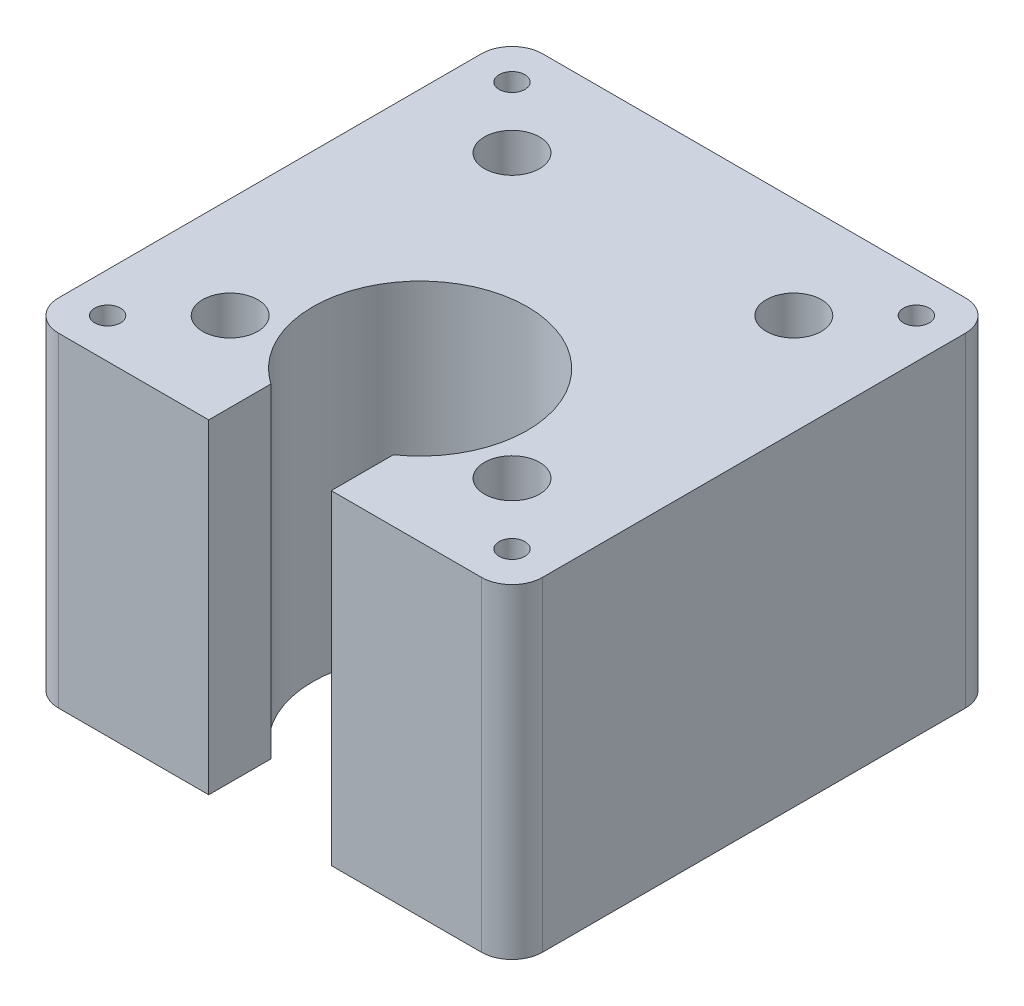
ISO-10303-21;
HEADER;
FILE_DESCRIPTION(('STEP AP214'),'2;1');
FILE_NAME('part.step','',(''),(''),'','','');
FILE_SCHEMA(('AUTOMOTIVE_DESIGN { 1 0 10303 214 1 1 1 1 }'));
ENDSEC;
DATA;
#1=APPLICATION_CONTEXT('core data for automotive mechanical design processes');
#2=APPLICATION_PROTOCOL_DEFINITION('international standard','automotive_design',2000,#1);
#3=PRODUCT_CONTEXT('',#1,'mechanical');
#4=PRODUCT('Part','Part','',(#3));
#5=PRODUCT_RELATED_PRODUCT_CATEGORY('part','',(#4));
#6=PRODUCT_DEFINITION_FORMATION('','',#4);
#7=PRODUCT_DEFINITION_CONTEXT('part definition',#1,'design');
#8=PRODUCT_DEFINITION('design','',#6,#7);
#9=PRODUCT_DEFINITION_SHAPE('','',#8);
#10=(LENGTH_UNIT() NAMED_UNIT(*) SI_UNIT(.MILLI.,.METRE.));
#11=(NAMED_UNIT(*) PLANE_ANGLE_UNIT() SI_UNIT($,.RADIAN.));
#12=(NAMED_UNIT(*) SI_UNIT($,.STERADIAN.) SOLID_ANGLE_UNIT());
#13=UNCERTAINTY_MEASURE_WITH_UNIT(LENGTH_MEASURE(1.E-05),#10,'distance_accuracy_value','');
#14=(GEOMETRIC_REPRESENTATION_CONTEXT(3) GLOBAL_UNCERTAINTY_ASSIGNED_CONTEXT((#13)) GLOBAL_UNIT_ASSIGNED_CONTEXT((#10,
#11,#12)) REPRESENTATION_CONTEXT('',''));
#15=CARTESIAN_POINT('',(0.,0.,0.));
#16=DIRECTION('',(0.,0.,1.));
#17=DIRECTION('',(1.,0.,0.));
#18=AXIS2_PLACEMENT_3D('',#15,#16,#17);
#19=CARTESIAN_POINT('',(-33.,-22.4000000001183,18.));
#20=DIRECTION('',(0.,1.,0.));
#21=DIRECTION('',(0.,0.,1.));
#22=AXIS2_PLACEMENT_3D('',#19,#20,#21);
#23=CONICAL_SURFACE('',#22,2.09999999978617,1.02974425843205);
#24=CARTESIAN_POINT('',(-33.,-23.661807300158,18.0000000003133));
#25=VERTEX_POINT('',#24);
#26=VERTEX_LOOP('',#25);
#27=FACE_BOUND('',#26,.T.);
#28=CARTESIAN_POINT('',(-33.,-22.4,18.));
#29=DIRECTION('',(0.,1.,0.));
#30=DIRECTION('',(0.,0.,1.));
#31=AXIS2_PLACEMENT_3D('',#28,#29,#30);
#32=CIRCLE('',#31,2.1);
#33=CARTESIAN_POINT('',(-33.,-22.4,20.1));
#34=VERTEX_POINT('',#33);
#35=EDGE_CURVE('E125',#34,#34,#32,.T.);
#36=ORIENTED_EDGE('',*,*,#35,.T.);
#37=EDGE_LOOP('',(#36));
#38=FACE_BOUND('',#37,.T.);
#39=ADVANCED_FACE('F17',(#27,#38),#23,.F.);
#40=CARTESIAN_POINT('',(33.,-22.4000000001183,18.));
#41=DIRECTION('',(0.,1.,0.));
#42=DIRECTION('',(0.,0.,1.));
#43=AXIS2_PLACEMENT_3D('',#40,#41,#42);
#44=CONICAL_SURFACE('',#43,2.09999999978617,1.02974425843205);
#45=CARTESIAN_POINT('',(33.,-23.661807300158,18.0000000003133));
#46=VERTEX_POINT('',#45);
#47=VERTEX_LOOP('',#46);
#48=FACE_BOUND('',#47,.T.);
#49=CARTESIAN_POINT('',(33.,-22.4,18.));
#50=DIRECTION('',(0.,1.,0.));
#51=DIRECTION('',(0.,0.,1.));
#52=AXIS2_PLACEMENT_3D('',#49,#50,#51);
#53=CIRCLE('',#52,2.1);
#54=CARTESIAN_POINT('',(33.,-22.4,20.1));
#55=VERTEX_POINT('',#54);
#56=EDGE_CURVE('E127',#55,#55,#53,.T.);
#57=ORIENTED_EDGE('',*,*,#56,.T.);
#58=EDGE_LOOP('',(#57));
#59=FACE_BOUND('',#58,.T.);
#60=ADVANCED_FACE('F122',(#48,#59),#44,.F.);
#61=CARTESIAN_POINT('',(33.,-22.4000000000046,-48.));
#62=DIRECTION('',(0.,1.,0.));
#63=DIRECTION('',(0.,0.,1.));
#64=AXIS2_PLACEMENT_3D('',#61,#62,#63);
#65=CONICAL_SURFACE('',#64,2.09999999992579,1.02974425866189);
#66=CARTESIAN_POINT('',(33.,-23.6618072999875,-47.999999999945));
#67=VERTEX_POINT('',#66);
#68=VERTEX_LOOP('',#67);
#69=FACE_BOUND('',#68,.T.);
#70=CARTESIAN_POINT('',(33.,-22.4,-48.));
#71=DIRECTION('',(0.,1.,0.));
#72=DIRECTION('',(0.,0.,1.));
#73=AXIS2_PLACEMENT_3D('',#70,#71,#72);
#74=CIRCLE('',#73,2.1);
#75=CARTESIAN_POINT('',(33.,-22.4,-45.9));
#76=VERTEX_POINT('',#75);
#77=EDGE_CURVE('E130',#76,#76,#74,.T.);
#78=ORIENTED_EDGE('',*,*,#77,.T.);
#79=EDGE_LOOP('',(#78));
#80=FACE_BOUND('',#79,.T.);
#81=ADVANCED_FACE('F450',(#69,#80),#65,.F.);
#82=CARTESIAN_POINT('',(-33.,-22.4000000000046,-48.));
#83=DIRECTION('',(0.,1.,0.));
#84=DIRECTION('',(0.,0.,1.));
#85=AXIS2_PLACEMENT_3D('',#82,#83,#84);
#86=CONICAL_SURFACE('',#85,2.09999999992579,1.02974425866189);
#87=CARTESIAN_POINT('',(-33.,-23.6618072999875,-47.999999999945));
#88=VERTEX_POINT('',#87);
#89=VERTEX_LOOP('',#88);
#90=FACE_BOUND('',#89,.T.);
#91=CARTESIAN_POINT('',(-33.,-22.4,-48.));
#92=DIRECTION('',(0.,1.,0.));
#93=DIRECTION('',(0.,0.,1.));
#94=AXIS2_PLACEMENT_3D('',#91,#92,#93);
#95=CIRCLE('',#94,2.1);
#96=CARTESIAN_POINT('',(-33.,-22.4,-45.9));
#97=VERTEX_POINT('',#96);
#98=EDGE_CURVE('E229',#97,#97,#95,.T.);
#99=ORIENTED_EDGE('',*,*,#98,.T.);
#100=EDGE_LOOP('',(#99));
#101=FACE_BOUND('',#100,.T.);
#102=ADVANCED_FACE('F447',(#90,#101),#86,.F.);
#103=CARTESIAN_POINT('',(-33.,0.,18.));
#104=DIRECTION('',(0.,1.,0.));
#105=DIRECTION('',(0.,0.,1.));
#106=AXIS2_PLACEMENT_3D('',#103,#104,#105);
#107=CYLINDRICAL_SURFACE('',#106,2.1);
#108=ORIENTED_EDGE('',*,*,#35,.F.);
#109=EDGE_LOOP('',(#108));
#110=FACE_BOUND('',#109,.T.);
#111=CARTESIAN_POINT('',(-33.,0.,18.));
#112=DIRECTION('',(0.,1.,0.));
#113=DIRECTION('',(0.,0.,1.));
#114=AXIS2_PLACEMENT_3D('',#111,#112,#113);
#115=CIRCLE('',#114,2.1);
#116=CARTESIAN_POINT('',(-33.,0.,20.1));
#117=VERTEX_POINT('',#116);
#118=EDGE_CURVE('E216',#117,#117,#115,.F.);
#119=ORIENTED_EDGE('',*,*,#118,.F.);
#120=EDGE_LOOP('',(#119));
#121=FACE_BOUND('',#120,.T.);
#122=ADVANCED_FACE('F443',(#110,#121),#107,.F.);
#123=CARTESIAN_POINT('',(33.,0.,18.));
#124=DIRECTION('',(0.,1.,0.));
#125=DIRECTION('',(0.,0.,1.));
#126=AXIS2_PLACEMENT_3D('',#123,#124,#125);
#127=CYLINDRICAL_SURFACE('',#126,2.1);
#128=ORIENTED_EDGE('',*,*,#56,.F.);
#129=EDGE_LOOP('',(#128));
#130=FACE_BOUND('',#129,.T.);
#131=CARTESIAN_POINT('',(33.,0.,18.));
#132=DIRECTION('',(0.,1.,0.));
#133=DIRECTION('',(0.,0.,1.));
#134=AXIS2_PLACEMENT_3D('',#131,#132,#133);
#135=CIRCLE('',#134,2.1);
#136=CARTESIAN_POINT('',(33.,0.,20.1));
#137=VERTEX_POINT('',#136);
#138=EDGE_CURVE('E213',#137,#137,#135,.F.);
#139=ORIENTED_EDGE('',*,*,#138,.F.);
#140=EDGE_LOOP('',(#139));
#141=FACE_BOUND('',#140,.T.);
#142=ADVANCED_FACE('F439',(#130,#141),#127,.F.);
#143=CARTESIAN_POINT('',(33.,0.,-48.));
#144=DIRECTION('',(0.,1.,0.));
#145=DIRECTION('',(0.,0.,1.));
#146=AXIS2_PLACEMENT_3D('',#143,#144,#145);
#147=CYLINDRICAL_SURFACE('',#146,2.1);
#148=ORIENTED_EDGE('',*,*,#77,.F.);
#149=EDGE_LOOP('',(#148));
#150=FACE_BOUND('',#149,.T.);
#151=CARTESIAN_POINT('',(33.,0.,-48.));
#152=DIRECTION('',(0.,1.,0.));
#153=DIRECTION('',(0.,0.,1.));
#154=AXIS2_PLACEMENT_3D('',#151,#152,#153);
#155=CIRCLE('',#154,2.1);
#156=CARTESIAN_POINT('',(33.,0.,-45.9));
#157=VERTEX_POINT('',#156);
#158=EDGE_CURVE('E210',#157,#157,#155,.F.);
#159=ORIENTED_EDGE('',*,*,#158,.F.);
#160=EDGE_LOOP('',(#159));
#161=FACE_BOUND('',#160,.T.);
#162=ADVANCED_FACE('F435',(#150,#161),#147,.F.);
#163=CARTESIAN_POINT('',(-33.,0.,-48.));
#164=DIRECTION('',(0.,1.,0.));
#165=DIRECTION('',(0.,0.,1.));
#166=AXIS2_PLACEMENT_3D('',#163,#164,#165);
#167=CYLINDRICAL_SURFACE('',#166,2.1);
#168=ORIENTED_EDGE('',*,*,#98,.F.);
#169=EDGE_LOOP('',(#168));
#170=FACE_BOUND('',#169,.T.);
#171=CARTESIAN_POINT('',(-33.,0.,-48.));
#172=DIRECTION('',(0.,1.,0.));
#173=DIRECTION('',(0.,0.,1.));
#174=AXIS2_PLACEMENT_3D('',#171,#172,#173);
#175=CIRCLE('',#174,2.1);
#176=CARTESIAN_POINT('',(-33.,0.,-45.9));
#177=VERTEX_POINT('',#176);
#178=EDGE_CURVE('E207',#177,#177,#175,.F.);
#179=ORIENTED_EDGE('',*,*,#178,.F.);
#180=EDGE_LOOP('',(#179));
#181=FACE_BOUND('',#180,.T.);
#182=ADVANCED_FACE('F431',(#170,#181),#167,.F.);
#183=CARTESIAN_POINT('',(-23.,-43.,-38.));
#184=DIRECTION('',(0.,1.,0.));
#185=DIRECTION('',(0.,0.,1.));
#186=AXIS2_PLACEMENT_3D('',#183,#184,#185);
#187=CYLINDRICAL_SURFACE('',#186,4.5);
#188=CARTESIAN_POINT('',(-23.,-43.,-38.));
#189=DIRECTION('',(0.,1.,0.));
#190=DIRECTION('',(0.,0.,1.));
#191=AXIS2_PLACEMENT_3D('',#188,#189,#190);
#192=CIRCLE('',#191,4.5);
#193=CARTESIAN_POINT('',(-23.,-43.,-33.5));
#194=VERTEX_POINT('',#193);
#195=EDGE_CURVE('E219',#194,#194,#192,.T.);
#196=ORIENTED_EDGE('',*,*,#195,.F.);
#197=EDGE_LOOP('',(#196));
#198=FACE_BOUND('',#197,.T.);
#199=CARTESIAN_POINT('',(-23.,0.,-38.));
#200=DIRECTION('',(0.,1.,0.));
#201=DIRECTION('',(0.,0.,1.));
#202=AXIS2_PLACEMENT_3D('',#199,#200,#201);
#203=CIRCLE('',#202,4.5);
#204=CARTESIAN_POINT('',(-23.,0.,-33.5));
#205=VERTEX_POINT('',#204);
#206=EDGE_CURVE('E204',#205,#205,#203,.F.);
#207=ORIENTED_EDGE('',*,*,#206,.F.);
#208=EDGE_LOOP('',(#207));
#209=FACE_BOUND('',#208,.T.);
#210=ADVANCED_FACE('F427',(#198,#209),#187,.F.);
#211=CARTESIAN_POINT('',(23.,-43.,-38.));
#212=DIRECTION('',(0.,1.,0.));
#213=DIRECTION('',(0.,0.,1.));
#214=AXIS2_PLACEMENT_3D('',#211,#212,#213);
#215=CYLINDRICAL_SURFACE('',#214,4.5);
#216=CARTESIAN_POINT('',(23.,-43.,-38.));
#217=DIRECTION('',(0.,1.,0.));
#218=DIRECTION('',(0.,0.,1.));
#219=AXIS2_PLACEMENT_3D('',#216,#217,#218);
#220=CIRCLE('',#219,4.5);
#221=CARTESIAN_POINT('',(23.,-43.,-33.5));
#222=VERTEX_POINT('',#221);
#223=EDGE_CURVE('E222',#222,#222,#220,.T.);
#224=ORIENTED_EDGE('',*,*,#223,.F.);
#225=EDGE_LOOP('',(#224));
#226=FACE_BOUND('',#225,.T.);
#227=CARTESIAN_POINT('',(23.,0.,-38.));
#228=DIRECTION('',(0.,1.,0.));
#229=DIRECTION('',(0.,0.,1.));
#230=AXIS2_PLACEMENT_3D('',#227,#228,#229);
#231=CIRCLE('',#230,4.5);
#232=CARTESIAN_POINT('',(23.,0.,-33.5));
#233=VERTEX_POINT('',#232);
#234=EDGE_CURVE('E201',#233,#233,#231,.F.);
#235=ORIENTED_EDGE('',*,*,#234,.F.);
#236=EDGE_LOOP('',(#235));
#237=FACE_BOUND('',#236,.T.);
#238=ADVANCED_FACE('F423',(#226,#237),#215,.F.);
#239=CARTESIAN_POINT('',(-23.,-43.,8.));
#240=DIRECTION('',(0.,1.,0.));
#241=DIRECTION('',(0.,0.,1.));
#242=AXIS2_PLACEMENT_3D('',#239,#240,#241);
#243=CYLINDRICAL_SURFACE('',#242,4.5);
#244=CARTESIAN_POINT('',(-23.,-43.,8.));
#245=DIRECTION('',(0.,1.,0.));
#246=DIRECTION('',(0.,0.,1.));
#247=AXIS2_PLACEMENT_3D('',#244,#245,#246);
#248=CIRCLE('',#247,4.5);
#249=CARTESIAN_POINT('',(-23.,-43.,12.5));
#250=VERTEX_POINT('',#249);
#251=EDGE_CURVE('E224',#250,#250,#248,.T.);
#252=ORIENTED_EDGE('',*,*,#251,.F.);
#253=EDGE_LOOP('',(#252));
#254=FACE_BOUND('',#253,.T.);
#255=CARTESIAN_POINT('',(-23.,0.,8.));
#256=DIRECTION('',(0.,1.,0.));
#257=DIRECTION('',(0.,0.,1.));
#258=AXIS2_PLACEMENT_3D('',#255,#256,#257);
#259=CIRCLE('',#258,4.5);
#260=CARTESIAN_POINT('',(-23.,0.,12.5));
#261=VERTEX_POINT('',#260);
#262=EDGE_CURVE('E198',#261,#261,#259,.F.);
#263=ORIENTED_EDGE('',*,*,#262,.F.);
#264=EDGE_LOOP('',(#263));
#265=FACE_BOUND('',#264,.T.);
#266=ADVANCED_FACE('F419',(#254,#265),#243,.F.);
#267=CARTESIAN_POINT('',(23.,-43.,8.));
#268=DIRECTION('',(0.,1.,0.));
#269=DIRECTION('',(0.,0.,1.));
#270=AXIS2_PLACEMENT_3D('',#267,#268,#269);
#271=CYLINDRICAL_SURFACE('',#270,4.5);
#272=CARTESIAN_POINT('',(23.,-43.,8.));
#273=DIRECTION('',(0.,1.,0.));
#274=DIRECTION('',(0.,0.,1.));
#275=AXIS2_PLACEMENT_3D('',#272,#273,#274);
#276=CIRCLE('',#275,4.5);
#277=CARTESIAN_POINT('',(23.,-43.,12.5));
#278=VERTEX_POINT('',#277);
#279=EDGE_CURVE('E20',#278,#278,#276,.T.);
#280=ORIENTED_EDGE('',*,*,#279,.F.);
#281=EDGE_LOOP('',(#280));
#282=FACE_BOUND('',#281,.T.);
#283=CARTESIAN_POINT('',(23.,0.,8.));
#284=DIRECTION('',(0.,1.,0.));
#285=DIRECTION('',(0.,0.,1.));
#286=AXIS2_PLACEMENT_3D('',#283,#284,#285);
#287=CIRCLE('',#286,4.5);
#288=CARTESIAN_POINT('',(23.,0.,12.5));
#289=VERTEX_POINT('',#288);
#290=EDGE_CURVE('E195',#289,#289,#287,.F.);
#291=ORIENTED_EDGE('',*,*,#290,.F.);
#292=EDGE_LOOP('',(#291));
#293=FACE_BOUND('',#292,.T.);
#294=ADVANCED_FACE('F416',(#282,#293),#271,.F.);
#295=CARTESIAN_POINT('',(23.,-43.,8.));
#296=DIRECTION('',(0.,1.,0.));
#297=DIRECTION('',(0.,0.,1.));
#298=AXIS2_PLACEMENT_3D('',#295,#296,#297);
#299=PLANE('',#298);
#300=ORIENTED_EDGE('',*,*,#279,.T.);
#301=EDGE_LOOP('',(#300));
#302=FACE_BOUND('',#301,.T.);
#303=CARTESIAN_POINT('',(23.,-43.,8.));
#304=DIRECTION('',(0.,1.,0.));
#305=DIRECTION('',(0.,0.,1.));
#306=AXIS2_PLACEMENT_3D('',#303,#304,#305);
#307=CIRCLE('',#306,2.75);
#308=CARTESIAN_POINT('',(23.,-43.,10.75));
#309=VERTEX_POINT('',#308);
#310=EDGE_CURVE('E192',#309,#309,#307,.F.);
#311=ORIENTED_EDGE('',*,*,#310,.T.);
#312=EDGE_LOOP('',(#311));
#313=FACE_BOUND('',#312,.T.);
#314=ADVANCED_FACE('F413',(#302,#313),#299,.T.);
#315=CARTESIAN_POINT('',(-23.,-43.,8.));
#316=DIRECTION('',(0.,1.,0.));
#317=DIRECTION('',(0.,0.,1.));
#318=AXIS2_PLACEMENT_3D('',#315,#316,#317);
#319=PLANE('',#318);
#320=ORIENTED_EDGE('',*,*,#251,.T.);
#321=EDGE_LOOP('',(#320));
#322=FACE_BOUND('',#321,.T.);
#323=CARTESIAN_POINT('',(-23.,-43.,8.));
#324=DIRECTION('',(0.,1.,0.));
#325=DIRECTION('',(0.,0.,1.));
#326=AXIS2_PLACEMENT_3D('',#323,#324,#325);
#327=CIRCLE('',#326,2.75);
#328=CARTESIAN_POINT('',(-23.,-43.,10.75));
#329=VERTEX_POINT('',#328);
#330=EDGE_CURVE('E189',#329,#329,#327,.F.);
#331=ORIENTED_EDGE('',*,*,#330,.T.);
#332=EDGE_LOOP('',(#331));
#333=FACE_BOUND('',#332,.T.);
#334=ADVANCED_FACE('F409',(#322,#333),#319,.T.);
#335=CARTESIAN_POINT('',(23.,-43.,-38.));
#336=DIRECTION('',(0.,1.,0.));
#337=DIRECTION('',(0.,0.,1.));
#338=AXIS2_PLACEMENT_3D('',#335,#336,#337);
#339=PLANE('',#338);
#340=ORIENTED_EDGE('',*,*,#223,.T.);
#341=EDGE_LOOP('',(#340));
#342=FACE_BOUND('',#341,.T.);
#343=CARTESIAN_POINT('',(23.,-43.,-38.));
#344=DIRECTION('',(0.,1.,0.));
#345=DIRECTION('',(0.,0.,1.));
#346=AXIS2_PLACEMENT_3D('',#343,#344,#345);
#347=CIRCLE('',#346,2.75);
#348=CARTESIAN_POINT('',(23.,-43.,-35.25));
#349=VERTEX_POINT('',#348);
#350=EDGE_CURVE('E186',#349,#349,#347,.F.);
#351=ORIENTED_EDGE('',*,*,#350,.T.);
#352=EDGE_LOOP('',(#351));
#353=FACE_BOUND('',#352,.T.);
#354=ADVANCED_FACE('F405',(#342,#353),#339,.T.);
#355=CARTESIAN_POINT('',(-23.,-43.,-38.));
#356=DIRECTION('',(0.,1.,0.));
#357=DIRECTION('',(0.,0.,1.));
#358=AXIS2_PLACEMENT_3D('',#355,#356,#357);
#359=PLANE('',#358);
#360=ORIENTED_EDGE('',*,*,#195,.T.);
#361=EDGE_LOOP('',(#360));
#362=FACE_BOUND('',#361,.T.);
#363=CARTESIAN_POINT('',(-23.,-43.,-38.));
#364=DIRECTION('',(0.,1.,0.));
#365=DIRECTION('',(0.,0.,1.));
#366=AXIS2_PLACEMENT_3D('',#363,#364,#365);
#367=CIRCLE('',#366,2.75);
#368=CARTESIAN_POINT('',(-23.,-43.,-35.25));
#369=VERTEX_POINT('',#368);
#370=EDGE_CURVE('E183',#369,#369,#367,.F.);
#371=ORIENTED_EDGE('',*,*,#370,.T.);
#372=EDGE_LOOP('',(#371));
#373=FACE_BOUND('',#372,.T.);
#374=ADVANCED_FACE('F401',(#362,#373),#359,.T.);
#375=CARTESIAN_POINT('',(34.5,0.,-49.5));
#376=DIRECTION('',(0.,1.,0.));
#377=DIRECTION('',(0.,0.,1.));
#378=AXIS2_PLACEMENT_3D('',#375,#376,#377);
#379=PLANE('',#378);
#380=DIRECTION('',(1.,0.,0.));
#381=VECTOR('',#380,1.);
#382=CARTESIAN_POINT('',(34.5,0.,24.5));
#383=LINE('',#382,#381);
#384=CARTESIAN_POINT('',(34.5,0.,24.5));
#385=VERTEX_POINT('',#384);
#386=CARTESIAN_POINT('',(10.,0.,24.5));
#387=VERTEX_POINT('',#386);
#388=EDGE_CURVE('E259',#385,#387,#383,.F.);
#389=ORIENTED_EDGE('',*,*,#388,.F.);
#390=CARTESIAN_POINT('',(34.5,0.,19.5));
#391=DIRECTION('',(0.,1.,0.));
#392=DIRECTION('',(0.,0.,1.));
#393=AXIS2_PLACEMENT_3D('',#390,#391,#392);
#394=CIRCLE('',#393,5.);
#395=CARTESIAN_POINT('',(39.5,0.,19.5));
#396=VERTEX_POINT('',#395);
#397=EDGE_CURVE('E164',#396,#385,#394,.F.);
#398=ORIENTED_EDGE('',*,*,#397,.F.);
#399=DIRECTION('',(0.,0.,-1.));
#400=VECTOR('',#399,1.);
#401=CARTESIAN_POINT('',(39.5,0.,-49.5));
#402=LINE('',#401,#400);
#403=CARTESIAN_POINT('',(39.5,0.,-49.5));
#404=VERTEX_POINT('',#403);
#405=EDGE_CURVE('E182',#404,#396,#402,.F.);
#406=ORIENTED_EDGE('',*,*,#405,.F.);
#407=CARTESIAN_POINT('',(34.5,0.,-49.5));
#408=DIRECTION('',(0.,1.,0.));
#409=DIRECTION('',(0.,0.,1.));
#410=AXIS2_PLACEMENT_3D('',#407,#408,#409);
#411=CIRCLE('',#410,5.);
#412=CARTESIAN_POINT('',(34.5,0.,-54.5));
#413=VERTEX_POINT('',#412);
#414=EDGE_CURVE('E105',#413,#404,#411,.F.);
#415=ORIENTED_EDGE('',*,*,#414,.F.);
#416=DIRECTION('',(-1.,0.,0.));
#417=VECTOR('',#416,1.);
#418=CARTESIAN_POINT('',(34.5,0.,-54.5));
#419=LINE('',#418,#417);
#420=CARTESIAN_POINT('',(-34.5,0.,-54.5));
#421=VERTEX_POINT('',#420);
#422=EDGE_CURVE('E99',#421,#413,#419,.F.);
#423=ORIENTED_EDGE('',*,*,#422,.F.);
#424=CARTESIAN_POINT('',(-34.5,0.,-49.5));
#425=DIRECTION('',(0.,1.,0.));
#426=DIRECTION('',(0.,0.,1.));
#427=AXIS2_PLACEMENT_3D('',#424,#425,#426);
#428=CIRCLE('',#427,5.);
#429=CARTESIAN_POINT('',(-39.5,0.,-49.5));
#430=VERTEX_POINT('',#429);
#431=EDGE_CURVE('E176',#430,#421,#428,.F.);
#432=ORIENTED_EDGE('',*,*,#431,.F.);
#433=DIRECTION('',(0.,0.,1.));
#434=VECTOR('',#433,1.);
#435=CARTESIAN_POINT('',(-39.5,0.,-49.5));
#436=LINE('',#435,#434);
#437=CARTESIAN_POINT('',(-39.5,0.,19.5));
#438=VERTEX_POINT('',#437);
#439=EDGE_CURVE('E239',#438,#430,#436,.F.);
#440=ORIENTED_EDGE('',*,*,#439,.F.);
#441=CARTESIAN_POINT('',(-34.5,0.,19.5));
#442=DIRECTION('',(0.,1.,0.));
#443=DIRECTION('',(0.,0.,1.));
#444=AXIS2_PLACEMENT_3D('',#441,#442,#443);
#445=CIRCLE('',#444,5.);
#446=CARTESIAN_POINT('',(-34.5,0.,24.5));
#447=VERTEX_POINT('',#446);
#448=EDGE_CURVE('E172',#447,#438,#445,.F.);
#449=ORIENTED_EDGE('',*,*,#448,.F.);
#450=DIRECTION('',(1.,0.,0.));
#451=VECTOR('',#450,1.);
#452=CARTESIAN_POINT('',(-10.,0.,24.5));
#453=LINE('',#452,#451);
#454=CARTESIAN_POINT('',(-10.0000000000002,0.,24.5));
#455=VERTEX_POINT('',#454);
#456=EDGE_CURVE('E243',#455,#447,#453,.F.);
#457=ORIENTED_EDGE('',*,*,#456,.F.);
#458=DIRECTION('',(0.,0.,-1.));
#459=VECTOR('',#458,1.);
#460=CARTESIAN_POINT('',(-10.,0.,14.36140661635));
#461=LINE('',#460,#459);
#462=CARTESIAN_POINT('',(-9.99999999999926,0.,14.3614066163456));
#463=VERTEX_POINT('',#462);
#464=EDGE_CURVE('E248',#463,#455,#461,.F.);
#465=ORIENTED_EDGE('',*,*,#464,.F.);
#466=CARTESIAN_POINT('',(0.,0.,0.));
#467=DIRECTION('',(0.,1.,0.));
#468=DIRECTION('',(0.,0.,1.));
#469=AXIS2_PLACEMENT_3D('',#466,#467,#468);
#470=CIRCLE('',#469,17.5);
#471=CARTESIAN_POINT('',(10.,0.,14.3614066163463));
#472=VERTEX_POINT('',#471);
#473=EDGE_CURVE('E167',#463,#472,#470,.F.);
#474=ORIENTED_EDGE('',*,*,#473,.T.);
#475=DIRECTION('',(0.,0.,1.));
#476=VECTOR('',#475,1.);
#477=CARTESIAN_POINT('',(10.,0.,14.36140661634));
#478=LINE('',#477,#476);
#479=EDGE_CURVE('E253',#387,#472,#478,.F.);
#480=ORIENTED_EDGE('',*,*,#479,.F.);
#481=EDGE_LOOP('',(#389,#398,#406,#415,#423,#432,#440,#449,#457,#465,#474,#480));
#482=FACE_BOUND('',#481,.T.);
#483=ORIENTED_EDGE('',*,*,#290,.T.);
#484=EDGE_LOOP('',(#483));
#485=FACE_BOUND('',#484,.T.);
#486=ORIENTED_EDGE('',*,*,#262,.T.);
#487=EDGE_LOOP('',(#486));
#488=FACE_BOUND('',#487,.T.);
#489=ORIENTED_EDGE('',*,*,#234,.T.);
#490=EDGE_LOOP('',(#489));
#491=FACE_BOUND('',#490,.T.);
#492=ORIENTED_EDGE('',*,*,#206,.T.);
#493=EDGE_LOOP('',(#492));
#494=FACE_BOUND('',#493,.T.);
#495=ORIENTED_EDGE('',*,*,#178,.T.);
#496=EDGE_LOOP('',(#495));
#497=FACE_BOUND('',#496,.T.);
#498=ORIENTED_EDGE('',*,*,#158,.T.);
#499=EDGE_LOOP('',(#498));
#500=FACE_BOUND('',#499,.T.);
#501=ORIENTED_EDGE('',*,*,#138,.T.);
#502=EDGE_LOOP('',(#501));
#503=FACE_BOUND('',#502,.T.);
#504=ORIENTED_EDGE('',*,*,#118,.T.);
#505=EDGE_LOOP('',(#504));
#506=FACE_BOUND('',#505,.T.);
#507=ADVANCED_FACE('F397',(#482,#485,#488,#491,#494,#497,#500,#503,#506),#379,.T.);
#508=CARTESIAN_POINT('',(23.,-53.,8.));
#509=DIRECTION('',(0.,1.,0.));
#510=DIRECTION('',(0.,0.,1.));
#511=AXIS2_PLACEMENT_3D('',#508,#509,#510);
#512=CYLINDRICAL_SURFACE('',#511,2.75);
#513=ORIENTED_EDGE('',*,*,#310,.F.);
#514=EDGE_LOOP('',(#513));
#515=FACE_BOUND('',#514,.T.);
#516=CARTESIAN_POINT('',(23.,-53.,8.));
#517=DIRECTION('',(0.,1.,0.));
#518=DIRECTION('',(0.,0.,1.));
#519=AXIS2_PLACEMENT_3D('',#516,#517,#518);
#520=CIRCLE('',#519,2.75);
#521=CARTESIAN_POINT('',(23.,-53.,10.75));
#522=VERTEX_POINT('',#521);
#523=EDGE_CURVE('E161',#522,#522,#520,.F.);
#524=ORIENTED_EDGE('',*,*,#523,.T.);
#525=EDGE_LOOP('',(#524));
#526=FACE_BOUND('',#525,.T.);
#527=ADVANCED_FACE('F393',(#515,#526),#512,.F.);
#528=CARTESIAN_POINT('',(-23.,-53.,8.));
#529=DIRECTION('',(0.,1.,0.));
#530=DIRECTION('',(0.,0.,1.));
#531=AXIS2_PLACEMENT_3D('',#528,#529,#530);
#532=CYLINDRICAL_SURFACE('',#531,2.75);
#533=ORIENTED_EDGE('',*,*,#330,.F.);
#534=EDGE_LOOP('',(#533));
#535=FACE_BOUND('',#534,.T.);
#536=CARTESIAN_POINT('',(-23.,-53.,8.));
#537=DIRECTION('',(0.,1.,0.));
#538=DIRECTION('',(0.,0.,1.));
#539=AXIS2_PLACEMENT_3D('',#536,#537,#538);
#540=CIRCLE('',#539,2.75);
#541=CARTESIAN_POINT('',(-23.,-53.,10.75));
#542=VERTEX_POINT('',#541);
#543=EDGE_CURVE('E158',#542,#542,#540,.F.);
#544=ORIENTED_EDGE('',*,*,#543,.T.);
#545=EDGE_LOOP('',(#544));
#546=FACE_BOUND('',#545,.T.);
#547=ADVANCED_FACE('F389',(#535,#546),#532,.F.);
#548=CARTESIAN_POINT('',(23.,-53.,-38.));
#549=DIRECTION('',(0.,1.,0.));
#550=DIRECTION('',(0.,0.,1.));
#551=AXIS2_PLACEMENT_3D('',#548,#549,#550);
#552=CYLINDRICAL_SURFACE('',#551,2.75);
#553=ORIENTED_EDGE('',*,*,#350,.F.);
#554=EDGE_LOOP('',(#553));
#555=FACE_BOUND('',#554,.T.);
#556=CARTESIAN_POINT('',(23.,-53.,-38.));
#557=DIRECTION('',(0.,1.,0.));
#558=DIRECTION('',(0.,0.,1.));
#559=AXIS2_PLACEMENT_3D('',#556,#557,#558);
#560=CIRCLE('',#559,2.75);
#561=CARTESIAN_POINT('',(23.,-53.,-35.25));
#562=VERTEX_POINT('',#561);
#563=EDGE_CURVE('E155',#562,#562,#560,.F.);
#564=ORIENTED_EDGE('',*,*,#563,.T.);
#565=EDGE_LOOP('',(#564));
#566=FACE_BOUND('',#565,.T.);
#567=ADVANCED_FACE('F385',(#555,#566),#552,.F.);
#568=CARTESIAN_POINT('',(-23.,-53.,-38.));
#569=DIRECTION('',(0.,1.,0.));
#570=DIRECTION('',(0.,0.,1.));
#571=AXIS2_PLACEMENT_3D('',#568,#569,#570);
#572=CYLINDRICAL_SURFACE('',#571,2.75);
#573=ORIENTED_EDGE('',*,*,#370,.F.);
#574=EDGE_LOOP('',(#573));
#575=FACE_BOUND('',#574,.T.);
#576=CARTESIAN_POINT('',(-23.,-53.,-38.));
#577=DIRECTION('',(0.,1.,0.));
#578=DIRECTION('',(0.,0.,1.));
#579=AXIS2_PLACEMENT_3D('',#576,#577,#578);
#580=CIRCLE('',#579,2.75);
#581=CARTESIAN_POINT('',(-23.,-53.,-35.25));
#582=VERTEX_POINT('',#581);
#583=EDGE_CURVE('E152',#582,#582,#580,.F.);
#584=ORIENTED_EDGE('',*,*,#583,.T.);
#585=EDGE_LOOP('',(#584));
#586=FACE_BOUND('',#585,.T.);
#587=ADVANCED_FACE('F382',(#575,#586),#572,.F.);
#588=CARTESIAN_POINT('',(39.5,-53.,-49.5));
#589=DIRECTION('',(1.,0.,0.));
#590=DIRECTION('',(0.,0.,-1.));
#591=AXIS2_PLACEMENT_3D('',#588,#589,#590);
#592=PLANE('',#591);
#593=DIRECTION('',(0.,1.,0.));
#594=VECTOR('',#593,1.);
#595=CARTESIAN_POINT('',(39.5,-53.,19.5));
#596=LINE('',#595,#594);
#597=CARTESIAN_POINT('',(39.5,-53.,19.5));
#598=VERTEX_POINT('',#597);
#599=EDGE_CURVE('E166',#598,#396,#596,.T.);
#600=ORIENTED_EDGE('',*,*,#599,.F.);
#601=DIRECTION('',(0.,0.,1.));
#602=VECTOR('',#601,1.);
#603=CARTESIAN_POINT('',(39.5,-53.,-49.5));
#604=LINE('',#603,#602);
#605=CARTESIAN_POINT('',(39.5,-53.,-49.5));
#606=VERTEX_POINT('',#605);
#607=EDGE_CURVE('E151',#598,#606,#604,.F.);
#608=ORIENTED_EDGE('',*,*,#607,.T.);
#609=DIRECTION('',(0.,1.,0.));
#610=VECTOR('',#609,1.);
#611=CARTESIAN_POINT('',(39.5,-53.,-49.5));
#612=LINE('',#611,#610);
#613=EDGE_CURVE('E181',#404,#606,#612,.F.);
#614=ORIENTED_EDGE('',*,*,#613,.F.);
#615=ORIENTED_EDGE('',*,*,#405,.T.);
#616=EDGE_LOOP('',(#600,#608,#614,#615));
#617=FACE_BOUND('',#616,.T.);
#618=ADVANCED_FACE('F349',(#617),#592,.T.);
#619=CARTESIAN_POINT('',(34.5,-53.,-49.5));
#620=DIRECTION('',(0.,1.,0.));
#621=DIRECTION('',(0.,0.,1.));
#622=AXIS2_PLACEMENT_3D('',#619,#620,#621);
#623=CYLINDRICAL_SURFACE('',#622,5.);
#624=ORIENTED_EDGE('',*,*,#613,.T.);
#625=CARTESIAN_POINT('',(34.5,-53.,-49.5));
#626=DIRECTION('',(0.,1.,0.));
#627=DIRECTION('',(0.,0.,1.));
#628=AXIS2_PLACEMENT_3D('',#625,#626,#627);
#629=CIRCLE('',#628,5.);
#630=CARTESIAN_POINT('',(34.5,-53.,-54.5));
#631=VERTEX_POINT('',#630);
#632=EDGE_CURVE('E148',#606,#631,#629,.T.);
#633=ORIENTED_EDGE('',*,*,#632,.T.);
#634=DIRECTION('',(0.,1.,0.));
#635=VECTOR('',#634,1.);
#636=CARTESIAN_POINT('',(34.5,-53.,-54.5));
#637=LINE('',#636,#635);
#638=EDGE_CURVE('E179',#413,#631,#637,.F.);
#639=ORIENTED_EDGE('',*,*,#638,.F.);
#640=ORIENTED_EDGE('',*,*,#414,.T.);
#641=EDGE_LOOP('',(#624,#633,#639,#640));
#642=FACE_BOUND('',#641,.T.);
#643=ADVANCED_FACE('F345',(#642),#623,.T.);
#644=CARTESIAN_POINT('',(34.5,-53.,-54.5));
#645=DIRECTION('',(0.,0.,-1.));
#646=DIRECTION('',(-1.,0.,0.));
#647=AXIS2_PLACEMENT_3D('',#644,#645,#646);
#648=PLANE('',#647);
#649=ORIENTED_EDGE('',*,*,#638,.T.);
#650=DIRECTION('',(1.,0.,0.));
#651=VECTOR('',#650,1.);
#652=CARTESIAN_POINT('',(34.5,-53.,-54.5));
#653=LINE('',#652,#651);
#654=CARTESIAN_POINT('',(-34.5,-53.,-54.5));
#655=VERTEX_POINT('',#654);
#656=EDGE_CURVE('E147',#631,#655,#653,.F.);
#657=ORIENTED_EDGE('',*,*,#656,.T.);
#658=DIRECTION('',(0.,1.,0.));
#659=VECTOR('',#658,1.);
#660=CARTESIAN_POINT('',(-34.5,-53.,-54.5));
#661=LINE('',#660,#659);
#662=EDGE_CURVE('E178',#421,#655,#661,.F.);
#663=ORIENTED_EDGE('',*,*,#662,.F.);
#664=ORIENTED_EDGE('',*,*,#422,.T.);
#665=EDGE_LOOP('',(#649,#657,#663,#664));
#666=FACE_BOUND('',#665,.T.);
#667=ADVANCED_FACE('F343',(#666),#648,.T.);
#668=CARTESIAN_POINT('',(-34.5,-53.,-49.5));
#669=DIRECTION('',(0.,1.,0.));
#670=DIRECTION('',(0.,0.,1.));
#671=AXIS2_PLACEMENT_3D('',#668,#669,#670);
#672=CYLINDRICAL_SURFACE('',#671,5.);
#673=ORIENTED_EDGE('',*,*,#662,.T.);
#674=CARTESIAN_POINT('',(-34.5,-53.,-49.5));
#675=DIRECTION('',(0.,1.,0.));
#676=DIRECTION('',(0.,0.,1.));
#677=AXIS2_PLACEMENT_3D('',#674,#675,#676);
#678=CIRCLE('',#677,5.);
#679=CARTESIAN_POINT('',(-39.5,-53.,-49.5));
#680=VERTEX_POINT('',#679);
#681=EDGE_CURVE('E144',#655,#680,#678,.T.);
#682=ORIENTED_EDGE('',*,*,#681,.T.);
#683=DIRECTION('',(0.,1.,0.));
#684=VECTOR('',#683,1.);
#685=CARTESIAN_POINT('',(-39.5,-53.,-49.5));
#686=LINE('',#685,#684);
#687=EDGE_CURVE('E175',#430,#680,#686,.F.);
#688=ORIENTED_EDGE('',*,*,#687,.F.);
#689=ORIENTED_EDGE('',*,*,#431,.T.);
#690=EDGE_LOOP('',(#673,#682,#688,#689));
#691=FACE_BOUND('',#690,.T.);
#692=ADVANCED_FACE('F342',(#691),#672,.T.);
#693=CARTESIAN_POINT('',(-39.5,-53.,-49.5));
#694=DIRECTION('',(-1.,0.,0.));
#695=DIRECTION('',(0.,0.,1.));
#696=AXIS2_PLACEMENT_3D('',#693,#694,#695);
#697=PLANE('',#696);
#698=ORIENTED_EDGE('',*,*,#687,.T.);
#699=DIRECTION('',(0.,0.,1.));
#700=VECTOR('',#699,1.);
#701=CARTESIAN_POINT('',(-39.5,-53.,-49.5));
#702=LINE('',#701,#700);
#703=CARTESIAN_POINT('',(-39.5,-53.,19.5));
#704=VERTEX_POINT('',#703);
#705=EDGE_CURVE('E143',#680,#704,#702,.T.);
#706=ORIENTED_EDGE('',*,*,#705,.T.);
#707=DIRECTION('',(0.,1.,0.));
#708=VECTOR('',#707,1.);
#709=CARTESIAN_POINT('',(-39.5,-53.,19.5));
#710=LINE('',#709,#708);
#711=EDGE_CURVE('E174',#438,#704,#710,.F.);
#712=ORIENTED_EDGE('',*,*,#711,.F.);
#713=ORIENTED_EDGE('',*,*,#439,.T.);
#714=EDGE_LOOP('',(#698,#706,#712,#713));
#715=FACE_BOUND('',#714,.T.);
#716=ADVANCED_FACE('F336',(#715),#697,.T.);
#717=CARTESIAN_POINT('',(-34.5,-53.,19.5));
#718=DIRECTION('',(0.,1.,0.));
#719=DIRECTION('',(0.,0.,1.));
#720=AXIS2_PLACEMENT_3D('',#717,#718,#719);
#721=CYLINDRICAL_SURFACE('',#720,5.);
#722=ORIENTED_EDGE('',*,*,#711,.T.);
#723=CARTESIAN_POINT('',(-34.5,-53.,19.5));
#724=DIRECTION('',(0.,1.,0.));
#725=DIRECTION('',(0.,0.,1.));
#726=AXIS2_PLACEMENT_3D('',#723,#724,#725);
#727=CIRCLE('',#726,5.);
#728=CARTESIAN_POINT('',(-34.5,-53.,24.5));
#729=VERTEX_POINT('',#728);
#730=EDGE_CURVE('E139',#704,#729,#727,.T.);
#731=ORIENTED_EDGE('',*,*,#730,.T.);
#732=DIRECTION('',(0.,1.,0.));
#733=VECTOR('',#732,1.);
#734=CARTESIAN_POINT('',(-34.5,-53.,24.5));
#735=LINE('',#734,#733);
#736=EDGE_CURVE('E245',#447,#729,#735,.F.);
#737=ORIENTED_EDGE('',*,*,#736,.F.);
#738=ORIENTED_EDGE('',*,*,#448,.T.);
#739=EDGE_LOOP('',(#722,#731,#737,#738));
#740=FACE_BOUND('',#739,.T.);
#741=ADVANCED_FACE('F332',(#740),#721,.T.);
#742=CARTESIAN_POINT('',(-10.,-53.,24.5));
#743=DIRECTION('',(0.,0.,1.));
#744=DIRECTION('',(1.,0.,0.));
#745=AXIS2_PLACEMENT_3D('',#742,#743,#744);
#746=PLANE('',#745);
#747=ORIENTED_EDGE('',*,*,#736,.T.);
#748=DIRECTION('',(1.,0.,0.));
#749=VECTOR('',#748,1.);
#750=CARTESIAN_POINT('',(34.5,-53.,24.5));
#751=LINE('',#750,#749);
#752=CARTESIAN_POINT('',(-10.0000000000001,-53.,24.5));
#753=VERTEX_POINT('',#752);
#754=EDGE_CURVE('E142',#729,#753,#751,.T.);
#755=ORIENTED_EDGE('',*,*,#754,.T.);
#756=DIRECTION('',(0.,1.,0.));
#757=VECTOR('',#756,1.);
#758=CARTESIAN_POINT('',(-10.0000000000002,-53.,24.5));
#759=LINE('',#758,#757);
#760=EDGE_CURVE('E171',#455,#753,#759,.F.);
#761=ORIENTED_EDGE('',*,*,#760,.F.);
#762=ORIENTED_EDGE('',*,*,#456,.T.);
#763=EDGE_LOOP('',(#747,#755,#761,#762));
#764=FACE_BOUND('',#763,.T.);
#765=ADVANCED_FACE('F326',(#764),#746,.T.);
#766=CARTESIAN_POINT('',(-10.,-53.,14.36140661635));
#767=DIRECTION('',(1.,0.,0.));
#768=DIRECTION('',(0.,0.,-1.));
#769=AXIS2_PLACEMENT_3D('',#766,#767,#768);
#770=PLANE('',#769);
#771=ORIENTED_EDGE('',*,*,#760,.T.);
#772=DIRECTION('',(0.,0.,1.));
#773=VECTOR('',#772,1.);
#774=CARTESIAN_POINT('',(-10.0000000000001,-53.,-49.5));
#775=LINE('',#774,#773);
#776=CARTESIAN_POINT('',(-9.99999999999929,-53.,14.3614066163456));
#777=VERTEX_POINT('',#776);
#778=EDGE_CURVE('E138',#753,#777,#775,.F.);
#779=ORIENTED_EDGE('',*,*,#778,.T.);
#780=DIRECTION('',(0.,1.,0.));
#781=VECTOR('',#780,1.);
#782=CARTESIAN_POINT('',(-9.99999999999851,-53.,14.3614066163461));
#783=LINE('',#782,#781);
#784=EDGE_CURVE('E170',#777,#463,#783,.T.);
#785=ORIENTED_EDGE('',*,*,#784,.T.);
#786=ORIENTED_EDGE('',*,*,#464,.T.);
#787=EDGE_LOOP('',(#771,#779,#785,#786));
#788=FACE_BOUND('',#787,.T.);
#789=ADVANCED_FACE('F322',(#788),#770,.T.);
#790=CARTESIAN_POINT('',(0.,-53.,0.));
#791=DIRECTION('',(0.,1.,0.));
#792=DIRECTION('',(0.,0.,1.));
#793=AXIS2_PLACEMENT_3D('',#790,#791,#792);
#794=CYLINDRICAL_SURFACE('',#793,17.5);
#795=CARTESIAN_POINT('',(0.,-53.,0.));
#796=DIRECTION('',(0.,1.,0.));
#797=DIRECTION('',(0.,0.,1.));
#798=AXIS2_PLACEMENT_3D('',#795,#796,#797);
#799=CIRCLE('',#798,17.5);
#800=CARTESIAN_POINT('',(9.99999999999975,-53.,14.3614066163465));
#801=VERTEX_POINT('',#800);
#802=EDGE_CURVE('E134',#777,#801,#799,.F.);
#803=ORIENTED_EDGE('',*,*,#802,.T.);
#804=DIRECTION('',(0.,1.,0.));
#805=VECTOR('',#804,1.);
#806=CARTESIAN_POINT('',(10.,-53.,14.3614066163475));
#807=LINE('',#806,#805);
#808=EDGE_CURVE('E255',#472,#801,#807,.F.);
#809=ORIENTED_EDGE('',*,*,#808,.F.);
#810=ORIENTED_EDGE('',*,*,#473,.F.);
#811=ORIENTED_EDGE('',*,*,#784,.F.);
#812=EDGE_LOOP('',(#803,#809,#810,#811));
#813=FACE_BOUND('',#812,.T.);
#814=ADVANCED_FACE('F317',(#813),#794,.F.);
#815=CARTESIAN_POINT('',(10.,-53.,14.36140661634));
#816=DIRECTION('',(-1.,0.,0.));
#817=DIRECTION('',(0.,0.,1.));
#818=AXIS2_PLACEMENT_3D('',#815,#816,#817);
#819=PLANE('',#818);
#820=ORIENTED_EDGE('',*,*,#808,.T.);
#821=DIRECTION('',(0.,0.,1.));
#822=VECTOR('',#821,1.);
#823=CARTESIAN_POINT('',(9.9999999999995,-53.,-49.5));
#824=LINE('',#823,#822);
#825=CARTESIAN_POINT('',(9.99999999999967,-53.,24.5));
#826=VERTEX_POINT('',#825);
#827=EDGE_CURVE('E137',#801,#826,#824,.T.);
#828=ORIENTED_EDGE('',*,*,#827,.T.);
#829=DIRECTION('',(0.,1.,0.));
#830=VECTOR('',#829,1.);
#831=CARTESIAN_POINT('',(10.,-53.,24.5));
#832=LINE('',#831,#830);
#833=EDGE_CURVE('E262',#387,#826,#832,.F.);
#834=ORIENTED_EDGE('',*,*,#833,.F.);
#835=ORIENTED_EDGE('',*,*,#479,.T.);
#836=EDGE_LOOP('',(#820,#828,#834,#835));
#837=FACE_BOUND('',#836,.T.);
#838=ADVANCED_FACE('F313',(#837),#819,.T.);
#839=CARTESIAN_POINT('',(34.5,-53.,24.5));
#840=DIRECTION('',(0.,0.,1.));
#841=DIRECTION('',(1.,0.,0.));
#842=AXIS2_PLACEMENT_3D('',#839,#840,#841);
#843=PLANE('',#842);
#844=ORIENTED_EDGE('',*,*,#833,.T.);
#845=DIRECTION('',(1.,0.,0.));
#846=VECTOR('',#845,1.);
#847=CARTESIAN_POINT('',(34.5,-53.,24.5));
#848=LINE('',#847,#846);
#849=CARTESIAN_POINT('',(34.5,-53.,24.5));
#850=VERTEX_POINT('',#849);
#851=EDGE_CURVE('E26',#826,#850,#848,.T.);
#852=ORIENTED_EDGE('',*,*,#851,.T.);
#853=DIRECTION('',(0.,1.,0.));
#854=VECTOR('',#853,1.);
#855=CARTESIAN_POINT('',(34.5,-53.,24.5));
#856=LINE('',#855,#854);
#857=EDGE_CURVE('E34',#385,#850,#856,.F.);
#858=ORIENTED_EDGE('',*,*,#857,.F.);
#859=ORIENTED_EDGE('',*,*,#388,.T.);
#860=EDGE_LOOP('',(#844,#852,#858,#859));
#861=FACE_BOUND('',#860,.T.);
#862=ADVANCED_FACE('F305',(#861),#843,.T.);
#863=CARTESIAN_POINT('',(34.5,-53.,19.5));
#864=DIRECTION('',(0.,1.,0.));
#865=DIRECTION('',(0.,0.,1.));
#866=AXIS2_PLACEMENT_3D('',#863,#864,#865);
#867=CYLINDRICAL_SURFACE('',#866,5.);
#868=ORIENTED_EDGE('',*,*,#857,.T.);
#869=CARTESIAN_POINT('',(34.5,-53.,19.5));
#870=DIRECTION('',(0.,1.,0.));
#871=DIRECTION('',(0.,0.,1.));
#872=AXIS2_PLACEMENT_3D('',#869,#870,#871);
#873=CIRCLE('',#872,5.);
#874=EDGE_CURVE('E11',#850,#598,#873,.T.);
#875=ORIENTED_EDGE('',*,*,#874,.T.);
#876=ORIENTED_EDGE('',*,*,#599,.T.);
#877=ORIENTED_EDGE('',*,*,#397,.T.);
#878=EDGE_LOOP('',(#868,#875,#876,#877));
#879=FACE_BOUND('',#878,.T.);
#880=ADVANCED_FACE('F351',(#879),#867,.T.);
#881=CARTESIAN_POINT('',(34.5,-53.,-49.5));
#882=DIRECTION('',(0.,1.,0.));
#883=DIRECTION('',(0.,0.,1.));
#884=AXIS2_PLACEMENT_3D('',#881,#882,#883);
#885=PLANE('',#884);
#886=ORIENTED_EDGE('',*,*,#851,.F.);
#887=ORIENTED_EDGE('',*,*,#827,.F.);
#888=ORIENTED_EDGE('',*,*,#802,.F.);
#889=ORIENTED_EDGE('',*,*,#778,.F.);
#890=ORIENTED_EDGE('',*,*,#754,.F.);
#891=ORIENTED_EDGE('',*,*,#730,.F.);
#892=ORIENTED_EDGE('',*,*,#705,.F.);
#893=ORIENTED_EDGE('',*,*,#681,.F.);
#894=ORIENTED_EDGE('',*,*,#656,.F.);
#895=ORIENTED_EDGE('',*,*,#632,.F.);
#896=ORIENTED_EDGE('',*,*,#607,.F.);
#897=ORIENTED_EDGE('',*,*,#874,.F.);
#898=EDGE_LOOP('',(#886,#887,#888,#889,#890,#891,#892,#893,#894,#895,#896,#897));
#899=FACE_BOUND('',#898,.T.);
#900=ORIENTED_EDGE('',*,*,#583,.F.);
#901=EDGE_LOOP('',(#900));
#902=FACE_BOUND('',#901,.T.);
#903=ORIENTED_EDGE('',*,*,#563,.F.);
#904=EDGE_LOOP('',(#903));
#905=FACE_BOUND('',#904,.T.);
#906=ORIENTED_EDGE('',*,*,#543,.F.);
#907=EDGE_LOOP('',(#906));
#908=FACE_BOUND('',#907,.T.);
#909=ORIENTED_EDGE('',*,*,#523,.F.);
#910=EDGE_LOOP('',(#909));
#911=FACE_BOUND('',#910,.T.);
#912=ADVANCED_FACE('F309',(#899,#902,#905,#908,#911),#885,.F.);
#913=CLOSED_SHELL('',(#39,#60,#81,#102,#122,#142,#162,#182,#210,#238,#266,#294,#314,#334,#354,
#374,#507,#527,#547,#567,#587,#618,#643,#667,#692,#716,#741,#765,#789,#814,#838,#862,#880,#912));
#914=MANIFOLD_SOLID_BREP('B1',#913);
#915=ADVANCED_BREP_SHAPE_REPRESENTATION('',(#18,#914),#14);
#916=SHAPE_DEFINITION_REPRESENTATION(#9,#915);
ENDSEC;
END-ISO-10303-21;
